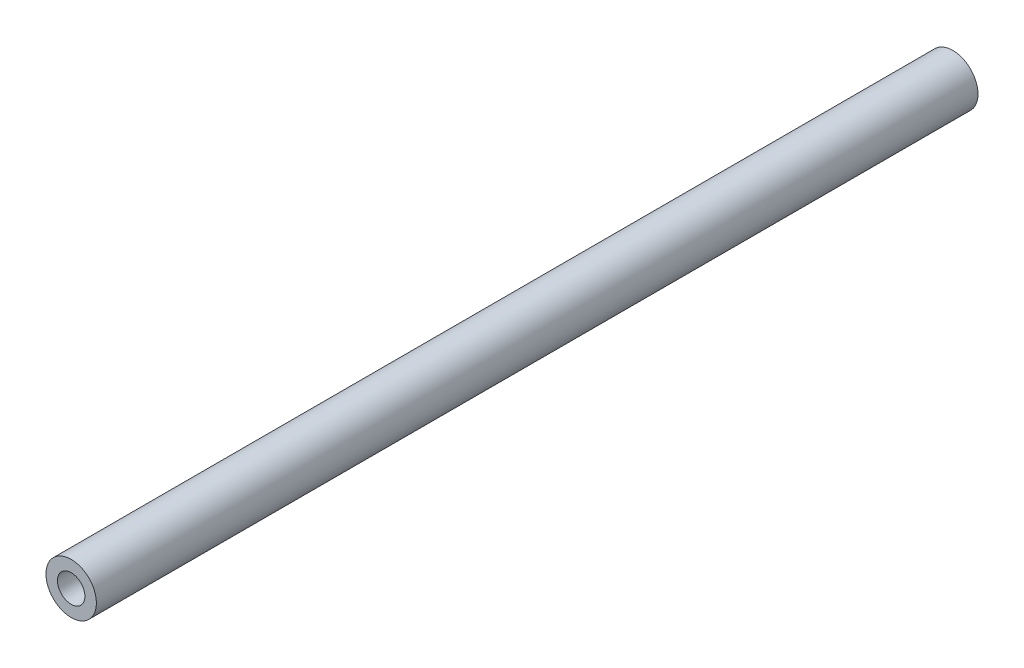
ISO-10303-21;
HEADER;
FILE_DESCRIPTION(('STEP AP214'),'2;1');
FILE_NAME('part.step','',(''),(''),'','','');
FILE_SCHEMA(('AUTOMOTIVE_DESIGN { 1 0 10303 214 1 1 1 1 }'));
ENDSEC;
DATA;
#1=APPLICATION_CONTEXT('core data for automotive mechanical design processes');
#2=APPLICATION_PROTOCOL_DEFINITION('international standard','automotive_design',2000,#1);
#3=PRODUCT_CONTEXT('',#1,'mechanical');
#4=PRODUCT('Part','Part','',(#3));
#5=PRODUCT_RELATED_PRODUCT_CATEGORY('part','',(#4));
#6=PRODUCT_DEFINITION_FORMATION('','',#4);
#7=PRODUCT_DEFINITION_CONTEXT('part definition',#1,'design');
#8=PRODUCT_DEFINITION('design','',#6,#7);
#9=PRODUCT_DEFINITION_SHAPE('','',#8);
#10=(LENGTH_UNIT() NAMED_UNIT(*) SI_UNIT(.MILLI.,.METRE.));
#11=(NAMED_UNIT(*) PLANE_ANGLE_UNIT() SI_UNIT($,.RADIAN.));
#12=(NAMED_UNIT(*) SI_UNIT($,.STERADIAN.) SOLID_ANGLE_UNIT());
#13=UNCERTAINTY_MEASURE_WITH_UNIT(LENGTH_MEASURE(1.E-05),#10,'distance_accuracy_value','');
#14=(GEOMETRIC_REPRESENTATION_CONTEXT(3) GLOBAL_UNCERTAINTY_ASSIGNED_CONTEXT((#13)) GLOBAL_UNIT_ASSIGNED_CONTEXT((#10,
#11,#12)) REPRESENTATION_CONTEXT('',''));
#15=CARTESIAN_POINT('',(0.,0.,0.));
#16=DIRECTION('',(0.,0.,1.));
#17=DIRECTION('',(1.,0.,0.));
#18=AXIS2_PLACEMENT_3D('',#15,#16,#17);
#19=CARTESIAN_POINT('',(0.,0.,-111.));
#20=DIRECTION('',(0.,0.,1.));
#21=DIRECTION('',(1.,0.,0.));
#22=AXIS2_PLACEMENT_3D('',#19,#20,#21);
#23=CYLINDRICAL_SURFACE('',#22,6.35);
#24=CARTESIAN_POINT('',(0.,0.,-111.));
#25=DIRECTION('',(0.,0.,1.));
#26=DIRECTION('',(1.,0.,0.));
#27=AXIS2_PLACEMENT_3D('',#24,#25,#26);
#28=CIRCLE('',#27,6.35);
#29=CARTESIAN_POINT('',(6.35,0.,-111.));
#30=VERTEX_POINT('',#29);
#31=EDGE_CURVE('E11',#30,#30,#28,.T.);
#32=ORIENTED_EDGE('',*,*,#31,.T.);
#33=EDGE_LOOP('',(#32));
#34=FACE_BOUND('',#33,.T.);
#35=CARTESIAN_POINT('',(0.,0.,111.));
#36=DIRECTION('',(0.,0.,1.));
#37=DIRECTION('',(1.,0.,0.));
#38=AXIS2_PLACEMENT_3D('',#35,#36,#37);
#39=CIRCLE('',#38,6.35);
#40=CARTESIAN_POINT('',(6.35,0.,111.));
#41=VERTEX_POINT('',#40);
#42=EDGE_CURVE('E47',#41,#41,#39,.T.);
#43=ORIENTED_EDGE('',*,*,#42,.F.);
#44=EDGE_LOOP('',(#43));
#45=FACE_BOUND('',#44,.T.);
#46=ADVANCED_FACE('F40',(#34,#45),#23,.T.);
#47=CARTESIAN_POINT('',(0.,0.,-111.));
#48=DIRECTION('',(0.,0.,1.));
#49=DIRECTION('',(1.,0.,0.));
#50=AXIS2_PLACEMENT_3D('',#47,#48,#49);
#51=PLANE('',#50);
#52=CARTESIAN_POINT('',(0.,0.,-111.));
#53=DIRECTION('',(0.,0.,-1.));
#54=DIRECTION('',(-1.,0.,0.));
#55=AXIS2_PLACEMENT_3D('',#52,#53,#54);
#56=CIRCLE('',#55,3.45439999999999);
#57=CARTESIAN_POINT('',(-3.45439999999999,0.,-111.));
#58=VERTEX_POINT('',#57);
#59=EDGE_CURVE('E64',#58,#58,#56,.T.);
#60=ORIENTED_EDGE('',*,*,#59,.F.);
#61=EDGE_LOOP('',(#60));
#62=FACE_BOUND('',#61,.T.);
#63=ORIENTED_EDGE('',*,*,#31,.F.);
#64=EDGE_LOOP('',(#63));
#65=FACE_BOUND('',#64,.T.);
#66=ADVANCED_FACE('F79',(#62,#65),#51,.F.);
#67=CARTESIAN_POINT('',(0.,0.,111.));
#68=DIRECTION('',(0.,0.,1.));
#69=DIRECTION('',(1.,0.,0.));
#70=AXIS2_PLACEMENT_3D('',#67,#68,#69);
#71=PLANE('',#70);
#72=CARTESIAN_POINT('',(0.,0.,111.));
#73=DIRECTION('',(0.,0.,1.));
#74=DIRECTION('',(1.,0.,0.));
#75=AXIS2_PLACEMENT_3D('',#72,#73,#74);
#76=CIRCLE('',#75,3.45439999999999);
#77=CARTESIAN_POINT('',(3.45439999999999,0.,111.));
#78=VERTEX_POINT('',#77);
#79=EDGE_CURVE('E63',#78,#78,#76,.T.);
#80=ORIENTED_EDGE('',*,*,#79,.F.);
#81=EDGE_LOOP('',(#80));
#82=FACE_BOUND('',#81,.T.);
#83=ORIENTED_EDGE('',*,*,#42,.T.);
#84=EDGE_LOOP('',(#83));
#85=FACE_BOUND('',#84,.T.);
#86=ADVANCED_FACE('F76',(#82,#85),#71,.T.);
#87=CARTESIAN_POINT('',(0.,0.,71.));
#88=DIRECTION('',(0.,0.,1.));
#89=DIRECTION('',(1.,0.,0.));
#90=AXIS2_PLACEMENT_3D('',#87,#88,#89);
#91=CONICAL_SURFACE('',#90,3.45439999999998,1.02974425867665);
#92=CARTESIAN_POINT('',(0.,0.,68.9243870776312));
#93=VERTEX_POINT('',#92);
#94=VERTEX_LOOP('',#93);
#95=FACE_BOUND('',#94,.T.);
#96=CARTESIAN_POINT('',(0.,0.,71.));
#97=DIRECTION('',(0.,0.,1.));
#98=DIRECTION('',(1.,0.,0.));
#99=AXIS2_PLACEMENT_3D('',#96,#97,#98);
#100=CIRCLE('',#99,3.45439999999998);
#101=CARTESIAN_POINT('',(3.45439999999998,0.,71.));
#102=VERTEX_POINT('',#101);
#103=EDGE_CURVE('E67',#102,#102,#100,.T.);
#104=ORIENTED_EDGE('',*,*,#103,.T.);
#105=EDGE_LOOP('',(#104));
#106=FACE_BOUND('',#105,.T.);
#107=ADVANCED_FACE('F90',(#95,#106),#91,.F.);
#108=CARTESIAN_POINT('',(0.,0.,111.));
#109=DIRECTION('',(0.,0.,1.));
#110=DIRECTION('',(1.,0.,0.));
#111=AXIS2_PLACEMENT_3D('',#108,#109,#110);
#112=CYLINDRICAL_SURFACE('',#111,3.45439999999999);
#113=ORIENTED_EDGE('',*,*,#103,.F.);
#114=EDGE_LOOP('',(#113));
#115=FACE_BOUND('',#114,.T.);
#116=ORIENTED_EDGE('',*,*,#79,.T.);
#117=EDGE_LOOP('',(#116));
#118=FACE_BOUND('',#117,.T.);
#119=ADVANCED_FACE('F57',(#115,#118),#112,.F.);
#120=CARTESIAN_POINT('',(0.,0.,-71.));
#121=DIRECTION('',(0.,0.,-1.));
#122=DIRECTION('',(-1.,0.,0.));
#123=AXIS2_PLACEMENT_3D('',#120,#121,#122);
#124=CONICAL_SURFACE('',#123,3.45439999999998,1.02974425867665);
#125=CARTESIAN_POINT('',(0.,0.,-68.9243870776312));
#126=VERTEX_POINT('',#125);
#127=VERTEX_LOOP('',#126);
#128=FACE_BOUND('',#127,.T.);
#129=CARTESIAN_POINT('',(0.,0.,-71.));
#130=DIRECTION('',(0.,0.,-1.));
#131=DIRECTION('',(-1.,0.,0.));
#132=AXIS2_PLACEMENT_3D('',#129,#130,#131);
#133=CIRCLE('',#132,3.45439999999998);
#134=CARTESIAN_POINT('',(-3.45439999999998,0.,-71.));
#135=VERTEX_POINT('',#134);
#136=EDGE_CURVE('E61',#135,#135,#133,.T.);
#137=ORIENTED_EDGE('',*,*,#136,.T.);
#138=EDGE_LOOP('',(#137));
#139=FACE_BOUND('',#138,.T.);
#140=ADVANCED_FACE('F53',(#128,#139),#124,.F.);
#141=CARTESIAN_POINT('',(0.,0.,-111.));
#142=DIRECTION('',(0.,0.,-1.));
#143=DIRECTION('',(-1.,0.,0.));
#144=AXIS2_PLACEMENT_3D('',#141,#142,#143);
#145=CYLINDRICAL_SURFACE('',#144,3.45439999999999);
#146=ORIENTED_EDGE('',*,*,#136,.F.);
#147=EDGE_LOOP('',(#146));
#148=FACE_BOUND('',#147,.T.);
#149=ORIENTED_EDGE('',*,*,#59,.T.);
#150=EDGE_LOOP('',(#149));
#151=FACE_BOUND('',#150,.T.);
#152=ADVANCED_FACE('F56',(#148,#151),#145,.F.);
#153=CLOSED_SHELL('',(#46,#66,#86,#107,#119,#140,#152));
#154=MANIFOLD_SOLID_BREP('B2',#153);
#155=ADVANCED_BREP_SHAPE_REPRESENTATION('',(#18,#154),#14);
#156=SHAPE_DEFINITION_REPRESENTATION(#9,#155);
ENDSEC;
END-ISO-10303-21;
